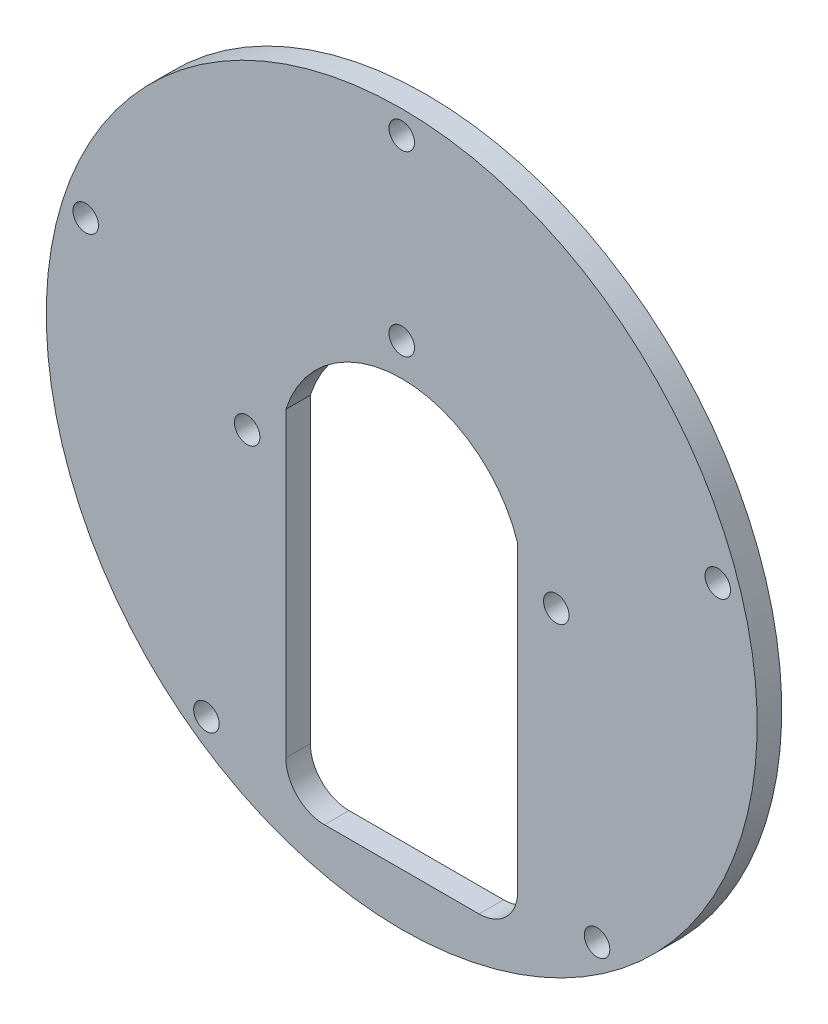
ISO-10303-21;
HEADER;
FILE_DESCRIPTION(('STEP AP214'),'2;1');
FILE_NAME('part.step','',(''),(''),'','','');
FILE_SCHEMA(('AUTOMOTIVE_DESIGN { 1 0 10303 214 1 1 1 1 }'));
ENDSEC;
DATA;
#1=APPLICATION_CONTEXT('core data for automotive mechanical design processes');
#2=APPLICATION_PROTOCOL_DEFINITION('international standard','automotive_design',2000,#1);
#3=PRODUCT_CONTEXT('',#1,'mechanical');
#4=PRODUCT('Part','Part','',(#3));
#5=PRODUCT_RELATED_PRODUCT_CATEGORY('part','',(#4));
#6=PRODUCT_DEFINITION_FORMATION('','',#4);
#7=PRODUCT_DEFINITION_CONTEXT('part definition',#1,'design');
#8=PRODUCT_DEFINITION('design','',#6,#7);
#9=PRODUCT_DEFINITION_SHAPE('','',#8);
#10=(LENGTH_UNIT() NAMED_UNIT(*) SI_UNIT(.MILLI.,.METRE.));
#11=(NAMED_UNIT(*) PLANE_ANGLE_UNIT() SI_UNIT($,.RADIAN.));
#12=(NAMED_UNIT(*) SI_UNIT($,.STERADIAN.) SOLID_ANGLE_UNIT());
#13=UNCERTAINTY_MEASURE_WITH_UNIT(LENGTH_MEASURE(1.E-05),#10,'distance_accuracy_value','');
#14=(GEOMETRIC_REPRESENTATION_CONTEXT(3) GLOBAL_UNCERTAINTY_ASSIGNED_CONTEXT((#13)) GLOBAL_UNIT_ASSIGNED_CONTEXT((#10,
#11,#12)) REPRESENTATION_CONTEXT('',''));
#15=CARTESIAN_POINT('',(0.,0.,0.));
#16=DIRECTION('',(0.,0.,1.));
#17=DIRECTION('',(1.,0.,0.));
#18=AXIS2_PLACEMENT_3D('',#15,#16,#17);
#19=CARTESIAN_POINT('',(-40.8954302006916,13.2877307581227,-31.175));
#20=DIRECTION('',(0.,0.,1.));
#21=DIRECTION('',(1.,0.,0.));
#22=AXIS2_PLACEMENT_3D('',#19,#20,#21);
#23=CYLINDRICAL_SURFACE('',#22,1.65);
#24=CARTESIAN_POINT('',(-40.8954302006916,13.2877307581227,-31.175));
#25=DIRECTION('',(0.,0.,-1.));
#26=DIRECTION('',(0.,1.,0.));
#27=AXIS2_PLACEMENT_3D('',#24,#25,#26);
#28=CIRCLE('',#27,1.65);
#29=CARTESIAN_POINT('',(-40.8954302006916,14.9377307581227,-31.175));
#30=VERTEX_POINT('',#29);
#31=EDGE_CURVE('E155',#30,#30,#28,.F.);
#32=ORIENTED_EDGE('',*,*,#31,.F.);
#33=EDGE_LOOP('',(#32));
#34=FACE_BOUND('',#33,.T.);
#35=CARTESIAN_POINT('',(-40.8954302006916,13.2877307581227,-28.));
#36=DIRECTION('',(0.,0.,-1.));
#37=DIRECTION('',(0.,1.,0.));
#38=AXIS2_PLACEMENT_3D('',#35,#36,#37);
#39=CIRCLE('',#38,1.65);
#40=CARTESIAN_POINT('',(-40.8954302006916,14.9377307581227,-28.));
#41=VERTEX_POINT('',#40);
#42=EDGE_CURVE('E143',#41,#41,#39,.F.);
#43=ORIENTED_EDGE('',*,*,#42,.T.);
#44=EDGE_LOOP('',(#43));
#45=FACE_BOUND('',#44,.T.);
#46=ADVANCED_FACE('F34',(#34,#45),#23,.F.);
#47=CARTESIAN_POINT('',(25.2747658485764,-34.7877307581227,-31.175));
#48=DIRECTION('',(0.,0.,1.));
#49=DIRECTION('',(1.,0.,0.));
#50=AXIS2_PLACEMENT_3D('',#47,#48,#49);
#51=CYLINDRICAL_SURFACE('',#50,1.65);
#52=CARTESIAN_POINT('',(25.2747658485764,-34.7877307581227,-31.175));
#53=DIRECTION('',(0.,0.,-1.));
#54=DIRECTION('',(0.,1.,0.));
#55=AXIS2_PLACEMENT_3D('',#52,#53,#54);
#56=CIRCLE('',#55,1.65);
#57=CARTESIAN_POINT('',(25.2747658485764,-33.1377307581227,-31.175));
#58=VERTEX_POINT('',#57);
#59=EDGE_CURVE('E152',#58,#58,#56,.F.);
#60=ORIENTED_EDGE('',*,*,#59,.F.);
#61=EDGE_LOOP('',(#60));
#62=FACE_BOUND('',#61,.T.);
#63=CARTESIAN_POINT('',(25.2747658485764,-34.7877307581227,-28.));
#64=DIRECTION('',(0.,0.,-1.));
#65=DIRECTION('',(0.,1.,0.));
#66=AXIS2_PLACEMENT_3D('',#63,#64,#65);
#67=CIRCLE('',#66,1.65);
#68=CARTESIAN_POINT('',(25.2747658485764,-33.1377307581227,-28.));
#69=VERTEX_POINT('',#68);
#70=EDGE_CURVE('E170',#69,#69,#67,.F.);
#71=ORIENTED_EDGE('',*,*,#70,.T.);
#72=EDGE_LOOP('',(#71));
#73=FACE_BOUND('',#72,.T.);
#74=ADVANCED_FACE('F207',(#62,#73),#51,.F.);
#75=CARTESIAN_POINT('',(0.,43.,-31.175));
#76=DIRECTION('',(0.,0.,1.));
#77=DIRECTION('',(1.,0.,0.));
#78=AXIS2_PLACEMENT_3D('',#75,#76,#77);
#79=CYLINDRICAL_SURFACE('',#78,1.65);
#80=CARTESIAN_POINT('',(0.,43.,-31.175));
#81=DIRECTION('',(0.,0.,-1.));
#82=DIRECTION('',(0.,1.,0.));
#83=AXIS2_PLACEMENT_3D('',#80,#81,#82);
#84=CIRCLE('',#83,1.65);
#85=CARTESIAN_POINT('',(0.,44.65,-31.175));
#86=VERTEX_POINT('',#85);
#87=EDGE_CURVE('E149',#86,#86,#84,.F.);
#88=ORIENTED_EDGE('',*,*,#87,.F.);
#89=EDGE_LOOP('',(#88));
#90=FACE_BOUND('',#89,.T.);
#91=CARTESIAN_POINT('',(0.,43.,-28.));
#92=DIRECTION('',(0.,0.,-1.));
#93=DIRECTION('',(0.,1.,0.));
#94=AXIS2_PLACEMENT_3D('',#91,#92,#93);
#95=CIRCLE('',#94,1.65);
#96=CARTESIAN_POINT('',(0.,44.65,-28.));
#97=VERTEX_POINT('',#96);
#98=EDGE_CURVE('E167',#97,#97,#95,.F.);
#99=ORIENTED_EDGE('',*,*,#98,.T.);
#100=EDGE_LOOP('',(#99));
#101=FACE_BOUND('',#100,.T.);
#102=ADVANCED_FACE('F213',(#90,#101),#79,.F.);
#103=CARTESIAN_POINT('',(0.,0.,-31.175));
#104=DIRECTION('',(0.,0.,1.));
#105=DIRECTION('',(1.,0.,0.));
#106=AXIS2_PLACEMENT_3D('',#103,#104,#105);
#107=CYLINDRICAL_SURFACE('',#106,46.);
#108=CARTESIAN_POINT('',(0.,0.,-31.175));
#109=DIRECTION('',(0.,0.,-1.));
#110=DIRECTION('',(0.,1.,0.));
#111=AXIS2_PLACEMENT_3D('',#108,#109,#110);
#112=CIRCLE('',#111,46.);
#113=CARTESIAN_POINT('',(0.,46.,-31.175));
#114=VERTEX_POINT('',#113);
#115=EDGE_CURVE('E146',#114,#114,#112,.T.);
#116=ORIENTED_EDGE('',*,*,#115,.F.);
#117=EDGE_LOOP('',(#116));
#118=FACE_BOUND('',#117,.T.);
#119=CARTESIAN_POINT('',(0.,0.,-28.));
#120=DIRECTION('',(0.,0.,-1.));
#121=DIRECTION('',(0.,1.,0.));
#122=AXIS2_PLACEMENT_3D('',#119,#120,#121);
#123=CIRCLE('',#122,46.);
#124=CARTESIAN_POINT('',(0.,46.,-28.));
#125=VERTEX_POINT('',#124);
#126=EDGE_CURVE('E164',#125,#125,#123,.T.);
#127=ORIENTED_EDGE('',*,*,#126,.T.);
#128=EDGE_LOOP('',(#127));
#129=FACE_BOUND('',#128,.T.);
#130=ADVANCED_FACE('F223',(#118,#129),#107,.T.);
#131=CARTESIAN_POINT('',(40.8954302006916,13.2877307581227,-31.175));
#132=DIRECTION('',(0.,0.,1.));
#133=DIRECTION('',(1.,0.,0.));
#134=AXIS2_PLACEMENT_3D('',#131,#132,#133);
#135=CYLINDRICAL_SURFACE('',#134,1.65);
#136=CARTESIAN_POINT('',(40.8954302006916,13.2877307581227,-31.175));
#137=DIRECTION('',(0.,0.,-1.));
#138=DIRECTION('',(0.,1.,0.));
#139=AXIS2_PLACEMENT_3D('',#136,#137,#138);
#140=CIRCLE('',#139,1.65);
#141=CARTESIAN_POINT('',(40.8954302006916,14.9377307581227,-31.175));
#142=VERTEX_POINT('',#141);
#143=EDGE_CURVE('E142',#142,#142,#140,.F.);
#144=ORIENTED_EDGE('',*,*,#143,.F.);
#145=EDGE_LOOP('',(#144));
#146=FACE_BOUND('',#145,.T.);
#147=CARTESIAN_POINT('',(40.8954302006916,13.2877307581227,-28.));
#148=DIRECTION('',(0.,0.,-1.));
#149=DIRECTION('',(0.,1.,0.));
#150=AXIS2_PLACEMENT_3D('',#147,#148,#149);
#151=CIRCLE('',#150,1.65);
#152=CARTESIAN_POINT('',(40.8954302006916,14.9377307581227,-28.));
#153=VERTEX_POINT('',#152);
#154=EDGE_CURVE('E161',#153,#153,#151,.F.);
#155=ORIENTED_EDGE('',*,*,#154,.T.);
#156=EDGE_LOOP('',(#155));
#157=FACE_BOUND('',#156,.T.);
#158=ADVANCED_FACE('F227',(#146,#157),#135,.F.);
#159=CARTESIAN_POINT('',(-25.2747658485763,-34.7877307581227,-31.175));
#160=DIRECTION('',(0.,0.,1.));
#161=DIRECTION('',(1.,0.,0.));
#162=AXIS2_PLACEMENT_3D('',#159,#160,#161);
#163=CYLINDRICAL_SURFACE('',#162,1.65);
#164=CARTESIAN_POINT('',(-25.2747658485763,-34.7877307581227,-31.175));
#165=DIRECTION('',(0.,0.,-1.));
#166=DIRECTION('',(0.,1.,0.));
#167=AXIS2_PLACEMENT_3D('',#164,#165,#166);
#168=CIRCLE('',#167,1.65);
#169=CARTESIAN_POINT('',(-25.2747658485763,-33.1377307581227,-31.175));
#170=VERTEX_POINT('',#169);
#171=EDGE_CURVE('E139',#170,#170,#168,.F.);
#172=ORIENTED_EDGE('',*,*,#171,.F.);
#173=EDGE_LOOP('',(#172));
#174=FACE_BOUND('',#173,.T.);
#175=CARTESIAN_POINT('',(-25.2747658485763,-34.7877307581227,-28.));
#176=DIRECTION('',(0.,0.,-1.));
#177=DIRECTION('',(0.,1.,0.));
#178=AXIS2_PLACEMENT_3D('',#175,#176,#177);
#179=CIRCLE('',#178,1.65);
#180=CARTESIAN_POINT('',(-25.2747658485763,-33.1377307581227,-28.));
#181=VERTEX_POINT('',#180);
#182=EDGE_CURVE('E128',#181,#181,#179,.F.);
#183=ORIENTED_EDGE('',*,*,#182,.T.);
#184=EDGE_LOOP('',(#183));
#185=FACE_BOUND('',#184,.T.);
#186=ADVANCED_FACE('F231',(#174,#185),#163,.F.);
#187=CARTESIAN_POINT('',(0.,0.,-31.175));
#188=DIRECTION('',(0.,0.,-1.));
#189=DIRECTION('',(0.,1.,0.));
#190=AXIS2_PLACEMENT_3D('',#187,#188,#189);
#191=PLANE('',#190);
#192=CARTESIAN_POINT('',(0.,0.,-31.175));
#193=DIRECTION('',(0.,0.,-1.));
#194=DIRECTION('',(0.,1.,0.));
#195=AXIS2_PLACEMENT_3D('',#192,#193,#194);
#196=CIRCLE('',#195,15.75);
#197=CARTESIAN_POINT('',(-15.,4.80234317807464,-31.175));
#198=VERTEX_POINT('',#197);
#199=CARTESIAN_POINT('',(15.,4.80234317807464,-31.175));
#200=VERTEX_POINT('',#199);
#201=EDGE_CURVE('E101',#198,#200,#196,.T.);
#202=ORIENTED_EDGE('',*,*,#201,.F.);
#203=DIRECTION('',(0.,1.,0.));
#204=VECTOR('',#203,1.);
#205=CARTESIAN_POINT('',(-15.,4.80234317807464,-31.175));
#206=LINE('',#205,#204);
#207=CARTESIAN_POINT('',(-15.,-34.25,-31.175));
#208=VERTEX_POINT('',#207);
#209=EDGE_CURVE('E102',#208,#198,#206,.T.);
#210=ORIENTED_EDGE('',*,*,#209,.F.);
#211=CARTESIAN_POINT('',(-9.99999999999999,-34.25,-31.175));
#212=DIRECTION('',(0.,0.,-1.));
#213=DIRECTION('',(0.,1.,0.));
#214=AXIS2_PLACEMENT_3D('',#211,#212,#213);
#215=CIRCLE('',#214,5.);
#216=CARTESIAN_POINT('',(-9.99999999999999,-39.25,-31.175));
#217=VERTEX_POINT('',#216);
#218=EDGE_CURVE('E183',#208,#217,#215,.F.);
#219=ORIENTED_EDGE('',*,*,#218,.T.);
#220=DIRECTION('',(-1.,0.,0.));
#221=VECTOR('',#220,1.);
#222=CARTESIAN_POINT('',(15.,-39.25,-31.175));
#223=LINE('',#222,#221);
#224=CARTESIAN_POINT('',(10.,-39.25,-31.175));
#225=VERTEX_POINT('',#224);
#226=EDGE_CURVE('E116',#225,#217,#223,.T.);
#227=ORIENTED_EDGE('',*,*,#226,.F.);
#228=CARTESIAN_POINT('',(9.99999999999999,-34.25,-31.175));
#229=DIRECTION('',(0.,0.,-1.));
#230=DIRECTION('',(0.,1.,0.));
#231=AXIS2_PLACEMENT_3D('',#228,#229,#230);
#232=CIRCLE('',#231,5.);
#233=CARTESIAN_POINT('',(15.,-34.25,-31.175));
#234=VERTEX_POINT('',#233);
#235=EDGE_CURVE('E42',#225,#234,#232,.F.);
#236=ORIENTED_EDGE('',*,*,#235,.T.);
#237=DIRECTION('',(0.,-1.,0.));
#238=VECTOR('',#237,1.);
#239=CARTESIAN_POINT('',(15.,4.80234317807464,-31.175));
#240=LINE('',#239,#238);
#241=EDGE_CURVE('E109',#200,#234,#240,.T.);
#242=ORIENTED_EDGE('',*,*,#241,.F.);
#243=EDGE_LOOP('',(#202,#210,#219,#227,#236,#242));
#244=FACE_BOUND('',#243,.T.);
#245=CARTESIAN_POINT('',(0.,20.,-31.175));
#246=DIRECTION('',(0.,0.,-1.));
#247=DIRECTION('',(0.,1.,0.));
#248=AXIS2_PLACEMENT_3D('',#245,#246,#247);
#249=CIRCLE('',#248,1.65);
#250=CARTESIAN_POINT('',(0.,21.65,-31.175));
#251=VERTEX_POINT('',#250);
#252=EDGE_CURVE('E121',#251,#251,#249,.T.);
#253=ORIENTED_EDGE('',*,*,#252,.F.);
#254=EDGE_LOOP('',(#253));
#255=FACE_BOUND('',#254,.T.);
#256=CARTESIAN_POINT('',(-20.,0.,-31.175));
#257=DIRECTION('',(0.,0.,-1.));
#258=DIRECTION('',(0.,1.,0.));
#259=AXIS2_PLACEMENT_3D('',#256,#257,#258);
#260=CIRCLE('',#259,1.65);
#261=CARTESIAN_POINT('',(-20.,1.65000000000008,-31.175));
#262=VERTEX_POINT('',#261);
#263=EDGE_CURVE('E129',#262,#262,#260,.T.);
#264=ORIENTED_EDGE('',*,*,#263,.F.);
#265=EDGE_LOOP('',(#264));
#266=FACE_BOUND('',#265,.T.);
#267=CARTESIAN_POINT('',(20.,0.,-31.175));
#268=DIRECTION('',(0.,0.,-1.));
#269=DIRECTION('',(0.,1.,0.));
#270=AXIS2_PLACEMENT_3D('',#267,#268,#269);
#271=CIRCLE('',#270,1.65);
#272=CARTESIAN_POINT('',(20.,1.64999999999992,-31.175));
#273=VERTEX_POINT('',#272);
#274=EDGE_CURVE('E91',#273,#273,#271,.T.);
#275=ORIENTED_EDGE('',*,*,#274,.F.);
#276=EDGE_LOOP('',(#275));
#277=FACE_BOUND('',#276,.T.);
#278=ORIENTED_EDGE('',*,*,#171,.T.);
#279=EDGE_LOOP('',(#278));
#280=FACE_BOUND('',#279,.T.);
#281=ORIENTED_EDGE('',*,*,#143,.T.);
#282=EDGE_LOOP('',(#281));
#283=FACE_BOUND('',#282,.T.);
#284=ORIENTED_EDGE('',*,*,#115,.T.);
#285=EDGE_LOOP('',(#284));
#286=FACE_BOUND('',#285,.T.);
#287=ORIENTED_EDGE('',*,*,#87,.T.);
#288=EDGE_LOOP('',(#287));
#289=FACE_BOUND('',#288,.T.);
#290=ORIENTED_EDGE('',*,*,#59,.T.);
#291=EDGE_LOOP('',(#290));
#292=FACE_BOUND('',#291,.T.);
#293=ORIENTED_EDGE('',*,*,#31,.T.);
#294=EDGE_LOOP('',(#293));
#295=FACE_BOUND('',#294,.T.);
#296=ADVANCED_FACE('F196',(#244,#255,#266,#277,#280,#283,#286,#289,#292,#295),#191,.T.);
#297=CARTESIAN_POINT('',(0.,0.,-28.));
#298=DIRECTION('',(0.,0.,-1.));
#299=DIRECTION('',(0.,1.,0.));
#300=AXIS2_PLACEMENT_3D('',#297,#298,#299);
#301=PLANE('',#300);
#302=DIRECTION('',(0.,-1.,0.));
#303=VECTOR('',#302,1.);
#304=CARTESIAN_POINT('',(-15.,4.80234317807464,-28.));
#305=LINE('',#304,#303);
#306=CARTESIAN_POINT('',(-15.,4.80234317807464,-28.));
#307=VERTEX_POINT('',#306);
#308=CARTESIAN_POINT('',(-15.,-34.25,-28.));
#309=VERTEX_POINT('',#308);
#310=EDGE_CURVE('E107',#307,#309,#305,.T.);
#311=ORIENTED_EDGE('',*,*,#310,.F.);
#312=CARTESIAN_POINT('',(0.,0.,-28.));
#313=DIRECTION('',(0.,0.,-1.));
#314=DIRECTION('',(0.,1.,0.));
#315=AXIS2_PLACEMENT_3D('',#312,#313,#314);
#316=CIRCLE('',#315,15.75);
#317=CARTESIAN_POINT('',(15.,4.80234317807464,-28.));
#318=VERTEX_POINT('',#317);
#319=EDGE_CURVE('E98',#318,#307,#316,.F.);
#320=ORIENTED_EDGE('',*,*,#319,.F.);
#321=DIRECTION('',(0.,1.,0.));
#322=VECTOR('',#321,1.);
#323=CARTESIAN_POINT('',(15.,4.80234317807464,-28.));
#324=LINE('',#323,#322);
#325=CARTESIAN_POINT('',(15.,-34.25,-28.));
#326=VERTEX_POINT('',#325);
#327=EDGE_CURVE('E84',#326,#318,#324,.T.);
#328=ORIENTED_EDGE('',*,*,#327,.F.);
#329=CARTESIAN_POINT('',(9.99999999999999,-34.25,-28.));
#330=DIRECTION('',(0.,0.,-1.));
#331=DIRECTION('',(0.,1.,0.));
#332=AXIS2_PLACEMENT_3D('',#329,#330,#331);
#333=CIRCLE('',#332,5.);
#334=CARTESIAN_POINT('',(9.99999999999999,-39.25,-28.));
#335=VERTEX_POINT('',#334);
#336=EDGE_CURVE('E11',#326,#335,#333,.T.);
#337=ORIENTED_EDGE('',*,*,#336,.T.);
#338=DIRECTION('',(1.,0.,0.));
#339=VECTOR('',#338,1.);
#340=CARTESIAN_POINT('',(15.,-39.25,-28.));
#341=LINE('',#340,#339);
#342=CARTESIAN_POINT('',(-9.99999999999999,-39.25,-28.));
#343=VERTEX_POINT('',#342);
#344=EDGE_CURVE('E111',#343,#335,#341,.T.);
#345=ORIENTED_EDGE('',*,*,#344,.F.);
#346=CARTESIAN_POINT('',(-9.99999999999999,-34.25,-28.));
#347=DIRECTION('',(0.,0.,-1.));
#348=DIRECTION('',(0.,1.,0.));
#349=AXIS2_PLACEMENT_3D('',#346,#347,#348);
#350=CIRCLE('',#349,5.);
#351=EDGE_CURVE('E185',#343,#309,#350,.T.);
#352=ORIENTED_EDGE('',*,*,#351,.T.);
#353=EDGE_LOOP('',(#311,#320,#328,#337,#345,#352));
#354=FACE_BOUND('',#353,.T.);
#355=CARTESIAN_POINT('',(0.,20.,-28.));
#356=DIRECTION('',(0.,0.,-1.));
#357=DIRECTION('',(0.,1.,0.));
#358=AXIS2_PLACEMENT_3D('',#355,#356,#357);
#359=CIRCLE('',#358,1.65);
#360=CARTESIAN_POINT('',(0.,21.65,-28.));
#361=VERTEX_POINT('',#360);
#362=EDGE_CURVE('E124',#361,#361,#359,.F.);
#363=ORIENTED_EDGE('',*,*,#362,.F.);
#364=EDGE_LOOP('',(#363));
#365=FACE_BOUND('',#364,.T.);
#366=CARTESIAN_POINT('',(-20.,0.,-28.));
#367=DIRECTION('',(0.,0.,-1.));
#368=DIRECTION('',(0.,1.,0.));
#369=AXIS2_PLACEMENT_3D('',#366,#367,#368);
#370=CIRCLE('',#369,1.65);
#371=CARTESIAN_POINT('',(-20.,1.65000000000008,-28.));
#372=VERTEX_POINT('',#371);
#373=EDGE_CURVE('E125',#372,#372,#370,.F.);
#374=ORIENTED_EDGE('',*,*,#373,.F.);
#375=EDGE_LOOP('',(#374));
#376=FACE_BOUND('',#375,.T.);
#377=CARTESIAN_POINT('',(20.,0.,-28.));
#378=DIRECTION('',(0.,0.,-1.));
#379=DIRECTION('',(0.,1.,0.));
#380=AXIS2_PLACEMENT_3D('',#377,#378,#379);
#381=CIRCLE('',#380,1.65);
#382=CARTESIAN_POINT('',(20.,1.64999999999992,-28.));
#383=VERTEX_POINT('',#382);
#384=EDGE_CURVE('E132',#383,#383,#381,.F.);
#385=ORIENTED_EDGE('',*,*,#384,.F.);
#386=EDGE_LOOP('',(#385));
#387=FACE_BOUND('',#386,.T.);
#388=ORIENTED_EDGE('',*,*,#182,.F.);
#389=EDGE_LOOP('',(#388));
#390=FACE_BOUND('',#389,.T.);
#391=ORIENTED_EDGE('',*,*,#154,.F.);
#392=EDGE_LOOP('',(#391));
#393=FACE_BOUND('',#392,.T.);
#394=ORIENTED_EDGE('',*,*,#126,.F.);
#395=EDGE_LOOP('',(#394));
#396=FACE_BOUND('',#395,.T.);
#397=ORIENTED_EDGE('',*,*,#98,.F.);
#398=EDGE_LOOP('',(#397));
#399=FACE_BOUND('',#398,.T.);
#400=ORIENTED_EDGE('',*,*,#70,.F.);
#401=EDGE_LOOP('',(#400));
#402=FACE_BOUND('',#401,.T.);
#403=ORIENTED_EDGE('',*,*,#42,.F.);
#404=EDGE_LOOP('',(#403));
#405=FACE_BOUND('',#404,.T.);
#406=ADVANCED_FACE('F104',(#354,#365,#376,#387,#390,#393,#396,#399,#402,#405),#301,.F.);
#407=CARTESIAN_POINT('',(20.,0.,4.176));
#408=DIRECTION('',(0.,0.,-1.));
#409=DIRECTION('',(0.,1.,0.));
#410=AXIS2_PLACEMENT_3D('',#407,#408,#409);
#411=CYLINDRICAL_SURFACE('',#410,1.65);
#412=ORIENTED_EDGE('',*,*,#274,.T.);
#413=EDGE_LOOP('',(#412));
#414=FACE_BOUND('',#413,.T.);
#415=ORIENTED_EDGE('',*,*,#384,.T.);
#416=EDGE_LOOP('',(#415));
#417=FACE_BOUND('',#416,.T.);
#418=ADVANCED_FACE('F244',(#414,#417),#411,.F.);
#419=CARTESIAN_POINT('',(-20.,0.,4.176));
#420=DIRECTION('',(0.,0.,-1.));
#421=DIRECTION('',(0.,1.,0.));
#422=AXIS2_PLACEMENT_3D('',#419,#420,#421);
#423=CYLINDRICAL_SURFACE('',#422,1.65);
#424=ORIENTED_EDGE('',*,*,#263,.T.);
#425=EDGE_LOOP('',(#424));
#426=FACE_BOUND('',#425,.T.);
#427=ORIENTED_EDGE('',*,*,#373,.T.);
#428=EDGE_LOOP('',(#427));
#429=FACE_BOUND('',#428,.T.);
#430=ADVANCED_FACE('F261',(#426,#429),#423,.F.);
#431=CARTESIAN_POINT('',(0.,20.,4.17600000000001));
#432=DIRECTION('',(0.,0.,-1.));
#433=DIRECTION('',(0.,1.,0.));
#434=AXIS2_PLACEMENT_3D('',#431,#432,#433);
#435=CYLINDRICAL_SURFACE('',#434,1.65);
#436=ORIENTED_EDGE('',*,*,#252,.T.);
#437=EDGE_LOOP('',(#436));
#438=FACE_BOUND('',#437,.T.);
#439=ORIENTED_EDGE('',*,*,#362,.T.);
#440=EDGE_LOOP('',(#439));
#441=FACE_BOUND('',#440,.T.);
#442=ADVANCED_FACE('F267',(#438,#441),#435,.F.);
#443=CARTESIAN_POINT('',(0.,0.,4.176));
#444=DIRECTION('',(0.,0.,-1.));
#445=DIRECTION('',(0.,1.,0.));
#446=AXIS2_PLACEMENT_3D('',#443,#444,#445);
#447=CYLINDRICAL_SURFACE('',#446,15.75);
#448=ORIENTED_EDGE('',*,*,#319,.T.);
#449=DIRECTION('',(0.,0.,-1.));
#450=VECTOR('',#449,1.);
#451=CARTESIAN_POINT('',(-15.,4.80234317807464,4.176));
#452=LINE('',#451,#450);
#453=EDGE_CURVE('E92',#307,#198,#452,.T.);
#454=ORIENTED_EDGE('',*,*,#453,.T.);
#455=ORIENTED_EDGE('',*,*,#201,.T.);
#456=DIRECTION('',(0.,0.,-1.));
#457=VECTOR('',#456,1.);
#458=CARTESIAN_POINT('',(15.,4.80234317807464,4.176));
#459=LINE('',#458,#457);
#460=EDGE_CURVE('E87',#318,#200,#459,.T.);
#461=ORIENTED_EDGE('',*,*,#460,.F.);
#462=EDGE_LOOP('',(#448,#454,#455,#461));
#463=FACE_BOUND('',#462,.T.);
#464=ADVANCED_FACE('F96',(#463),#447,.F.);
#465=CARTESIAN_POINT('',(-15.,4.80234317807464,4.176));
#466=DIRECTION('',(-1.,0.,0.));
#467=DIRECTION('',(0.,-1.,0.));
#468=AXIS2_PLACEMENT_3D('',#465,#466,#467);
#469=PLANE('',#468);
#470=ORIENTED_EDGE('',*,*,#310,.T.);
#471=DIRECTION('',(0.,0.,-1.));
#472=VECTOR('',#471,1.);
#473=CARTESIAN_POINT('',(-15.,-34.25,-31.175));
#474=LINE('',#473,#472);
#475=EDGE_CURVE('E158',#309,#208,#474,.T.);
#476=ORIENTED_EDGE('',*,*,#475,.T.);
#477=ORIENTED_EDGE('',*,*,#209,.T.);
#478=ORIENTED_EDGE('',*,*,#453,.F.);
#479=EDGE_LOOP('',(#470,#476,#477,#478));
#480=FACE_BOUND('',#479,.T.);
#481=ADVANCED_FACE('F193',(#480),#469,.F.);
#482=CARTESIAN_POINT('',(15.,-39.25,4.176));
#483=DIRECTION('',(0.,-1.,0.));
#484=DIRECTION('',(0.,0.,-1.));
#485=AXIS2_PLACEMENT_3D('',#482,#483,#484);
#486=PLANE('',#485);
#487=ORIENTED_EDGE('',*,*,#226,.T.);
#488=DIRECTION('',(0.,0.,-1.));
#489=VECTOR('',#488,1.);
#490=CARTESIAN_POINT('',(-9.99999999999999,-39.25,-28.));
#491=LINE('',#490,#489);
#492=EDGE_CURVE('E180',#217,#343,#491,.F.);
#493=ORIENTED_EDGE('',*,*,#492,.T.);
#494=ORIENTED_EDGE('',*,*,#344,.T.);
#495=DIRECTION('',(0.,0.,-1.));
#496=VECTOR('',#495,1.);
#497=CARTESIAN_POINT('',(9.99999999999999,-39.25,-31.175));
#498=LINE('',#497,#496);
#499=EDGE_CURVE('E177',#335,#225,#498,.T.);
#500=ORIENTED_EDGE('',*,*,#499,.T.);
#501=EDGE_LOOP('',(#487,#493,#494,#500));
#502=FACE_BOUND('',#501,.T.);
#503=ADVANCED_FACE('F199',(#502),#486,.F.);
#504=CARTESIAN_POINT('',(15.,4.80234317807464,4.176));
#505=DIRECTION('',(1.,0.,0.));
#506=DIRECTION('',(0.,1.,0.));
#507=AXIS2_PLACEMENT_3D('',#504,#505,#506);
#508=PLANE('',#507);
#509=ORIENTED_EDGE('',*,*,#241,.T.);
#510=DIRECTION('',(0.,0.,-1.));
#511=VECTOR('',#510,1.);
#512=CARTESIAN_POINT('',(15.,-34.25,-28.));
#513=LINE('',#512,#511);
#514=EDGE_CURVE('E55',#234,#326,#513,.F.);
#515=ORIENTED_EDGE('',*,*,#514,.T.);
#516=ORIENTED_EDGE('',*,*,#327,.T.);
#517=ORIENTED_EDGE('',*,*,#460,.T.);
#518=EDGE_LOOP('',(#509,#515,#516,#517));
#519=FACE_BOUND('',#518,.T.);
#520=ADVANCED_FACE('F86',(#519),#508,.F.);
#521=CARTESIAN_POINT('',(-9.99999999999999,-34.25,4.176));
#522=DIRECTION('',(0.,0.,1.));
#523=DIRECTION('',(0.,-1.,0.));
#524=AXIS2_PLACEMENT_3D('',#521,#522,#523);
#525=CYLINDRICAL_SURFACE('',#524,5.);
#526=ORIENTED_EDGE('',*,*,#351,.F.);
#527=ORIENTED_EDGE('',*,*,#492,.F.);
#528=ORIENTED_EDGE('',*,*,#218,.F.);
#529=ORIENTED_EDGE('',*,*,#475,.F.);
#530=EDGE_LOOP('',(#526,#527,#528,#529));
#531=FACE_BOUND('',#530,.T.);
#532=ADVANCED_FACE('F195',(#531),#525,.F.);
#533=CARTESIAN_POINT('',(9.99999999999999,-34.25,4.176));
#534=DIRECTION('',(0.,0.,1.));
#535=DIRECTION('',(0.,-1.,0.));
#536=AXIS2_PLACEMENT_3D('',#533,#534,#535);
#537=CYLINDRICAL_SURFACE('',#536,5.);
#538=ORIENTED_EDGE('',*,*,#336,.F.);
#539=ORIENTED_EDGE('',*,*,#514,.F.);
#540=ORIENTED_EDGE('',*,*,#235,.F.);
#541=ORIENTED_EDGE('',*,*,#499,.F.);
#542=EDGE_LOOP('',(#538,#539,#540,#541));
#543=FACE_BOUND('',#542,.T.);
#544=ADVANCED_FACE('F36',(#543),#537,.F.);
#545=CLOSED_SHELL('',(#46,#74,#102,#130,#158,#186,#296,#406,#418,#430,#442,#464,#481,#503,#520,
#532,#544));
#546=MANIFOLD_SOLID_BREP('B2',#545);
#547=ADVANCED_BREP_SHAPE_REPRESENTATION('',(#18,#546),#14);
#548=SHAPE_DEFINITION_REPRESENTATION(#9,#547);
ENDSEC;
END-ISO-10303-21;
